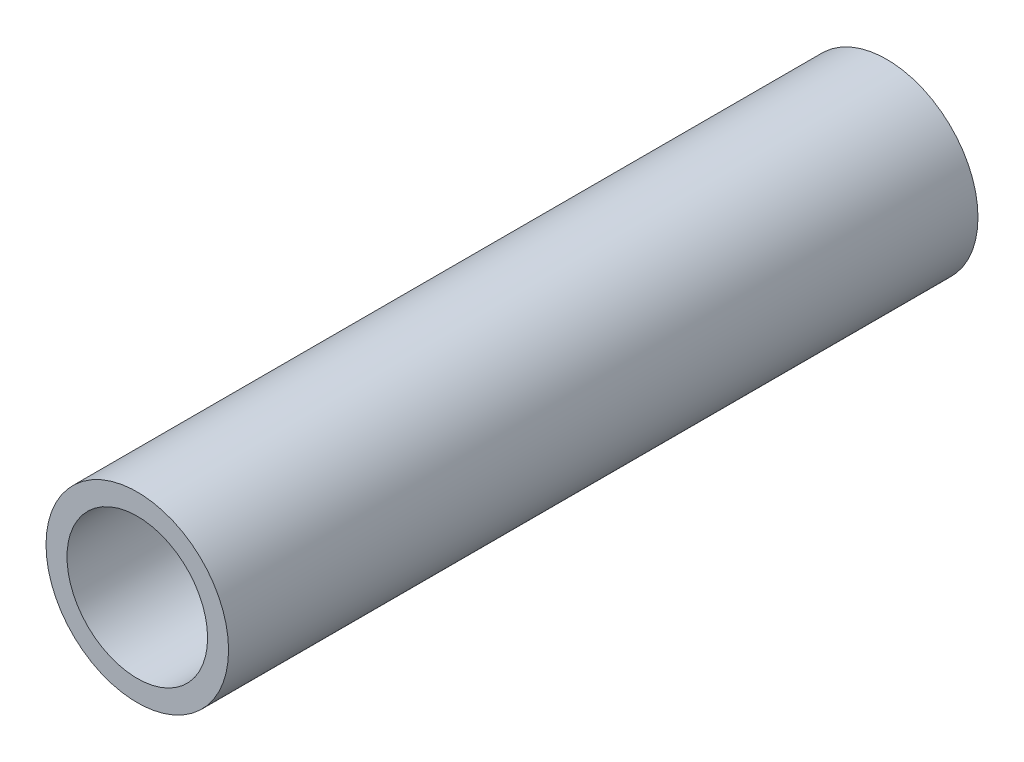
ISO-10303-21;
HEADER;
FILE_DESCRIPTION(('STEP AP214'),'2;1');
FILE_NAME('part.step','',(''),(''),'','','');
FILE_SCHEMA(('AUTOMOTIVE_DESIGN { 1 0 10303 214 1 1 1 1 }'));
ENDSEC;
DATA;
#1=APPLICATION_CONTEXT('core data for automotive mechanical design processes');
#2=APPLICATION_PROTOCOL_DEFINITION('international standard','automotive_design',2000,#1);
#3=PRODUCT_CONTEXT('',#1,'mechanical');
#4=PRODUCT('Part','Part','',(#3));
#5=PRODUCT_RELATED_PRODUCT_CATEGORY('part','',(#4));
#6=PRODUCT_DEFINITION_FORMATION('','',#4);
#7=PRODUCT_DEFINITION_CONTEXT('part definition',#1,'design');
#8=PRODUCT_DEFINITION('design','',#6,#7);
#9=PRODUCT_DEFINITION_SHAPE('','',#8);
#10=(LENGTH_UNIT() NAMED_UNIT(*) SI_UNIT(.MILLI.,.METRE.));
#11=(NAMED_UNIT(*) PLANE_ANGLE_UNIT() SI_UNIT($,.RADIAN.));
#12=(NAMED_UNIT(*) SI_UNIT($,.STERADIAN.) SOLID_ANGLE_UNIT());
#13=UNCERTAINTY_MEASURE_WITH_UNIT(LENGTH_MEASURE(1.E-05),#10,'distance_accuracy_value','');
#14=(GEOMETRIC_REPRESENTATION_CONTEXT(3) GLOBAL_UNCERTAINTY_ASSIGNED_CONTEXT((#13)) GLOBAL_UNIT_ASSIGNED_CONTEXT((#10,
#11,#12)) REPRESENTATION_CONTEXT('',''));
#15=CARTESIAN_POINT('',(0.,0.,0.));
#16=DIRECTION('',(0.,0.,1.));
#17=DIRECTION('',(1.,0.,0.));
#18=AXIS2_PLACEMENT_3D('',#15,#16,#17);
#19=CARTESIAN_POINT('',(0.,0.,250.));
#20=DIRECTION('',(0.,0.,1.));
#21=DIRECTION('',(1.,0.,0.));
#22=AXIS2_PLACEMENT_3D('',#19,#20,#21);
#23=PLANE('',#22);
#24=CARTESIAN_POINT('',(0.,0.,250.));
#25=DIRECTION('',(0.,0.,1.));
#26=DIRECTION('',(1.,0.,0.));
#27=AXIS2_PLACEMENT_3D('',#24,#25,#26);
#28=CIRCLE('',#27,30.4515);
#29=CARTESIAN_POINT('',(30.4515,0.,250.));
#30=VERTEX_POINT('',#29);
#31=EDGE_CURVE('E10',#30,#30,#28,.T.);
#32=ORIENTED_EDGE('',*,*,#31,.T.);
#33=EDGE_LOOP('',(#32));
#34=FACE_BOUND('',#33,.T.);
#35=CARTESIAN_POINT('',(0.,0.,250.));
#36=DIRECTION('',(0.,0.,1.));
#37=DIRECTION('',(1.,0.,0.));
#38=AXIS2_PLACEMENT_3D('',#35,#36,#37);
#39=CIRCLE('',#38,23.4515);
#40=CARTESIAN_POINT('',(23.4515,0.,250.));
#41=VERTEX_POINT('',#40);
#42=EDGE_CURVE('E50',#41,#41,#39,.T.);
#43=ORIENTED_EDGE('',*,*,#42,.F.);
#44=EDGE_LOOP('',(#43));
#45=FACE_BOUND('',#44,.T.);
#46=ADVANCED_FACE('F37',(#34,#45),#23,.T.);
#47=CARTESIAN_POINT('',(0.,0.,0.));
#48=DIRECTION('',(0.,0.,1.));
#49=DIRECTION('',(1.,0.,0.));
#50=AXIS2_PLACEMENT_3D('',#47,#48,#49);
#51=PLANE('',#50);
#52=CARTESIAN_POINT('',(0.,0.,0.));
#53=DIRECTION('',(0.,0.,1.));
#54=DIRECTION('',(1.,0.,0.));
#55=AXIS2_PLACEMENT_3D('',#52,#53,#54);
#56=CIRCLE('',#55,30.4515);
#57=CARTESIAN_POINT('',(30.4515,0.,0.));
#58=VERTEX_POINT('',#57);
#59=EDGE_CURVE('E41',#58,#58,#56,.T.);
#60=ORIENTED_EDGE('',*,*,#59,.F.);
#61=EDGE_LOOP('',(#60));
#62=FACE_BOUND('',#61,.T.);
#63=CARTESIAN_POINT('',(0.,0.,0.));
#64=DIRECTION('',(0.,0.,1.));
#65=DIRECTION('',(1.,0.,0.));
#66=AXIS2_PLACEMENT_3D('',#63,#64,#65);
#67=CIRCLE('',#66,23.4515);
#68=CARTESIAN_POINT('',(23.4515,0.,0.));
#69=VERTEX_POINT('',#68);
#70=EDGE_CURVE('E52',#69,#69,#67,.T.);
#71=ORIENTED_EDGE('',*,*,#70,.T.);
#72=EDGE_LOOP('',(#71));
#73=FACE_BOUND('',#72,.T.);
#74=ADVANCED_FACE('F64',(#62,#73),#51,.F.);
#75=CARTESIAN_POINT('',(0.,0.,250.));
#76=DIRECTION('',(0.,0.,-1.));
#77=DIRECTION('',(-1.,0.,0.));
#78=AXIS2_PLACEMENT_3D('',#75,#76,#77);
#79=CYLINDRICAL_SURFACE('',#78,30.4515);
#80=ORIENTED_EDGE('',*,*,#31,.F.);
#81=EDGE_LOOP('',(#80));
#82=FACE_BOUND('',#81,.T.);
#83=ORIENTED_EDGE('',*,*,#59,.T.);
#84=EDGE_LOOP('',(#83));
#85=FACE_BOUND('',#84,.T.);
#86=ADVANCED_FACE('F39',(#82,#85),#79,.T.);
#87=CARTESIAN_POINT('',(0.,0.,250.));
#88=DIRECTION('',(0.,0.,-1.));
#89=DIRECTION('',(-1.,0.,0.));
#90=AXIS2_PLACEMENT_3D('',#87,#88,#89);
#91=CYLINDRICAL_SURFACE('',#90,23.4515);
#92=ORIENTED_EDGE('',*,*,#42,.T.);
#93=EDGE_LOOP('',(#92));
#94=FACE_BOUND('',#93,.T.);
#95=ORIENTED_EDGE('',*,*,#70,.F.);
#96=EDGE_LOOP('',(#95));
#97=FACE_BOUND('',#96,.T.);
#98=ADVANCED_FACE('F60',(#94,#97),#91,.F.);
#99=CLOSED_SHELL('',(#46,#74,#86,#98));
#100=MANIFOLD_SOLID_BREP('B2',#99);
#101=ADVANCED_BREP_SHAPE_REPRESENTATION('',(#18,#100),#14);
#102=SHAPE_DEFINITION_REPRESENTATION(#9,#101);
ENDSEC;
END-ISO-10303-21;
